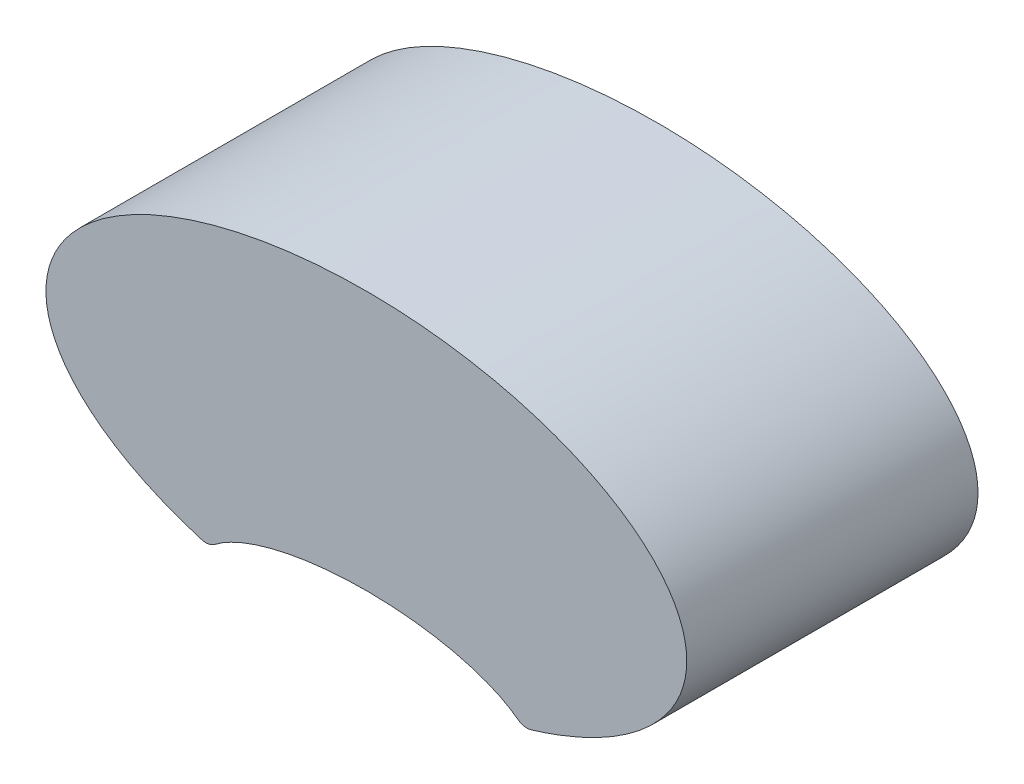
ISO-10303-21;
HEADER;
FILE_DESCRIPTION(('STEP AP214'),'2;1');
FILE_NAME('part.step','',(''),(''),'','','');
FILE_SCHEMA(('AUTOMOTIVE_DESIGN { 1 0 10303 214 1 1 1 1 }'));
ENDSEC;
DATA;
#1=APPLICATION_CONTEXT('core data for automotive mechanical design processes');
#2=APPLICATION_PROTOCOL_DEFINITION('international standard','automotive_design',2000,#1);
#3=PRODUCT_CONTEXT('',#1,'mechanical');
#4=PRODUCT('Part','Part','',(#3));
#5=PRODUCT_RELATED_PRODUCT_CATEGORY('part','',(#4));
#6=PRODUCT_DEFINITION_FORMATION('','',#4);
#7=PRODUCT_DEFINITION_CONTEXT('part definition',#1,'design');
#8=PRODUCT_DEFINITION('design','',#6,#7);
#9=PRODUCT_DEFINITION_SHAPE('','',#8);
#10=(LENGTH_UNIT() NAMED_UNIT(*) SI_UNIT(.MILLI.,.METRE.));
#11=(NAMED_UNIT(*) PLANE_ANGLE_UNIT() SI_UNIT($,.RADIAN.));
#12=(NAMED_UNIT(*) SI_UNIT($,.STERADIAN.) SOLID_ANGLE_UNIT());
#13=UNCERTAINTY_MEASURE_WITH_UNIT(LENGTH_MEASURE(1.E-05),#10,'distance_accuracy_value','');
#14=(GEOMETRIC_REPRESENTATION_CONTEXT(3) GLOBAL_UNCERTAINTY_ASSIGNED_CONTEXT((#13)) GLOBAL_UNIT_ASSIGNED_CONTEXT((#10,
#11,#12)) REPRESENTATION_CONTEXT('',''));
#15=CARTESIAN_POINT('',(0.,0.,0.));
#16=DIRECTION('',(0.,0.,1.));
#17=DIRECTION('',(1.,0.,0.));
#18=AXIS2_PLACEMENT_3D('',#15,#16,#17);
#19=CARTESIAN_POINT('',(0.,0.,-1.));
#20=DIRECTION('',(0.,0.,1.));
#21=DIRECTION('',(1.,0.,0.));
#22=AXIS2_PLACEMENT_3D('',#19,#20,#21);
#23=PLANE('',#22);
#24=CARTESIAN_POINT('',(0.,0.220517822577264,-1.));
#25=DIRECTION('',(0.,0.,1.));
#26=DIRECTION('',(1.,0.,0.));
#27=AXIS2_PLACEMENT_3D('',#24,#25,#26);
#28=ELLIPSE('',#27,0.580458558653862,0.220517822577264);
#29=CARTESIAN_POINT('',(-0.520495625253044,0.318128771506584,-1.));
#30=VERTEX_POINT('',#29);
#31=CARTESIAN_POINT('',(0.520495625253044,0.318128771506584,-1.));
#32=VERTEX_POINT('',#31);
#33=EDGE_CURVE('E79',#30,#32,#28,.F.);
#34=ORIENTED_EDGE('',*,*,#33,.F.);
#35=CARTESIAN_POINT('',(-0.55099028542075,0.357752952271063,-1.));
#36=DIRECTION('',(0.,0.,1.));
#37=DIRECTION('',(1.,0.,0.));
#38=AXIS2_PLACEMENT_3D('',#35,#36,#37);
#39=CIRCLE('',#38,0.05);
#40=CARTESIAN_POINT('',(-0.565338464899144,0.309855877771092,-1.));
#41=VERTEX_POINT('',#40);
#42=EDGE_CURVE('E150',#41,#30,#39,.T.);
#43=ORIENTED_EDGE('',*,*,#42,.F.);
#44=CARTESIAN_POINT('',(0.,0.781658914033439,-1.));
#45=DIRECTION('',(0.,0.,-1.));
#46=DIRECTION('',(1.,0.,0.));
#47=AXIS2_PLACEMENT_3D('',#44,#45,#46);
#48=ELLIPSE('',#47,1.1,0.55);
#49=CARTESIAN_POINT('',(0.565338464899143,0.309855877771092,-1.));
#50=VERTEX_POINT('',#49);
#51=EDGE_CURVE('E73',#50,#41,#48,.F.);
#52=ORIENTED_EDGE('',*,*,#51,.F.);
#53=CARTESIAN_POINT('',(0.55099028542075,0.357752952271063,-1.));
#54=DIRECTION('',(0.,0.,1.));
#55=DIRECTION('',(1.,0.,0.));
#56=AXIS2_PLACEMENT_3D('',#53,#54,#55);
#57=CIRCLE('',#56,0.05);
#58=EDGE_CURVE('E12',#32,#50,#57,.T.);
#59=ORIENTED_EDGE('',*,*,#58,.F.);
#60=EDGE_LOOP('',(#34,#43,#52,#59));
#61=FACE_BOUND('',#60,.T.);
#62=ADVANCED_FACE('F69',(#61),#23,.F.);
#63=CARTESIAN_POINT('',(0.55099028542075,0.357752952271063,-3.42659914665207));
#64=DIRECTION('',(0.,0.,1.));
#65=DIRECTION('',(1.,0.,0.));
#66=AXIS2_PLACEMENT_3D('',#63,#64,#65);
#67=CYLINDRICAL_SURFACE('',#66,0.05);
#68=DIRECTION('',(0.,0.,1.));
#69=VECTOR('',#68,1.);
#70=CARTESIAN_POINT('',(0.520495625253044,0.318128771506584,-3.42659914665207));
#71=LINE('',#70,#69);
#72=CARTESIAN_POINT('',(0.520495625253044,0.318128771506584,0.));
#73=VERTEX_POINT('',#72);
#74=EDGE_CURVE('E141',#32,#73,#71,.T.);
#75=ORIENTED_EDGE('',*,*,#74,.F.);
#76=ORIENTED_EDGE('',*,*,#58,.T.);
#77=DIRECTION('',(0.,0.,1.));
#78=VECTOR('',#77,1.);
#79=CARTESIAN_POINT('',(0.565338464899143,0.309855877771092,-3.42659914665207));
#80=LINE('',#79,#78);
#81=CARTESIAN_POINT('',(0.565338464899143,0.309855877771092,0.));
#82=VERTEX_POINT('',#81);
#83=EDGE_CURVE('E109',#50,#82,#80,.T.);
#84=ORIENTED_EDGE('',*,*,#83,.T.);
#85=CARTESIAN_POINT('',(0.55099028542075,0.357752952271063,0.));
#86=DIRECTION('',(0.,0.,1.));
#87=DIRECTION('',(1.,0.,0.));
#88=AXIS2_PLACEMENT_3D('',#85,#86,#87);
#89=CIRCLE('',#88,0.05);
#90=EDGE_CURVE('E113',#82,#73,#89,.F.);
#91=ORIENTED_EDGE('',*,*,#90,.T.);
#92=EDGE_LOOP('',(#75,#76,#84,#91));
#93=FACE_BOUND('',#92,.T.);
#94=ADVANCED_FACE('F71',(#93),#67,.T.);
#95=CARTESIAN_POINT('',(-0.55099028542075,0.357752952271063,-3.42659914665207));
#96=DIRECTION('',(0.,0.,1.));
#97=DIRECTION('',(1.,0.,0.));
#98=AXIS2_PLACEMENT_3D('',#95,#96,#97);
#99=CYLINDRICAL_SURFACE('',#98,0.05);
#100=DIRECTION('',(0.,0.,1.));
#101=VECTOR('',#100,1.);
#102=CARTESIAN_POINT('',(-0.565338464899144,0.309855877771092,-3.42659914665207));
#103=LINE('',#102,#101);
#104=CARTESIAN_POINT('',(-0.565338464899144,0.309855877771092,0.));
#105=VERTEX_POINT('',#104);
#106=EDGE_CURVE('E116',#41,#105,#103,.T.);
#107=ORIENTED_EDGE('',*,*,#106,.F.);
#108=ORIENTED_EDGE('',*,*,#42,.T.);
#109=DIRECTION('',(0.,0.,1.));
#110=VECTOR('',#109,1.);
#111=CARTESIAN_POINT('',(-0.520495625253044,0.318128771506584,-3.42659914665207));
#112=LINE('',#111,#110);
#113=CARTESIAN_POINT('',(-0.520495625253044,0.318128771506584,0.));
#114=VERTEX_POINT('',#113);
#115=EDGE_CURVE('E144',#30,#114,#112,.T.);
#116=ORIENTED_EDGE('',*,*,#115,.T.);
#117=CARTESIAN_POINT('',(-0.55099028542075,0.357752952271063,0.));
#118=DIRECTION('',(0.,0.,1.));
#119=DIRECTION('',(1.,0.,0.));
#120=AXIS2_PLACEMENT_3D('',#117,#118,#119);
#121=CIRCLE('',#120,0.05);
#122=EDGE_CURVE('E126',#114,#105,#121,.F.);
#123=ORIENTED_EDGE('',*,*,#122,.T.);
#124=EDGE_LOOP('',(#107,#108,#116,#123));
#125=FACE_BOUND('',#124,.T.);
#126=ADVANCED_FACE('F160',(#125),#99,.T.);
#127=CARTESIAN_POINT('',(0.,0.,0.));
#128=DIRECTION('',(0.,0.,1.));
#129=DIRECTION('',(1.,0.,0.));
#130=AXIS2_PLACEMENT_3D('',#127,#128,#129);
#131=PLANE('',#130);
#132=ORIENTED_EDGE('',*,*,#90,.F.);
#133=CARTESIAN_POINT('',(0.,0.781658914033439,0.));
#134=DIRECTION('',(0.,0.,-1.));
#135=DIRECTION('',(1.,0.,0.));
#136=AXIS2_PLACEMENT_3D('',#133,#134,#135);
#137=ELLIPSE('',#136,1.1,0.55);
#138=EDGE_CURVE('E119',#105,#82,#137,.T.);
#139=ORIENTED_EDGE('',*,*,#138,.F.);
#140=ORIENTED_EDGE('',*,*,#122,.F.);
#141=CARTESIAN_POINT('',(0.,0.220517822577264,0.));
#142=DIRECTION('',(0.,0.,1.));
#143=DIRECTION('',(1.,0.,0.));
#144=AXIS2_PLACEMENT_3D('',#141,#142,#143);
#145=ELLIPSE('',#144,0.580458558653862,0.220517822577264);
#146=EDGE_CURVE('E117',#73,#114,#145,.T.);
#147=ORIENTED_EDGE('',*,*,#146,.F.);
#148=EDGE_LOOP('',(#132,#139,#140,#147));
#149=FACE_BOUND('',#148,.T.);
#150=ADVANCED_FACE('F129',(#149),#131,.T.);
#151=CARTESIAN_POINT('',(0.,0.220517822577264,-3.42659914665207));
#152=DIRECTION('',(0.,0.,1.));
#153=DIRECTION('',(1.,0.,0.));
#154=AXIS2_PLACEMENT_3D('',#151,#152,#153);
#155=ELLIPSE('',#154,0.580458558653862,0.220517822577264);
#156=DIRECTION('',(0.,0.,1.));
#157=VECTOR('',#156,1.);
#158=SURFACE_OF_LINEAR_EXTRUSION('',#155,#157);
#159=ORIENTED_EDGE('',*,*,#115,.F.);
#160=ORIENTED_EDGE('',*,*,#33,.T.);
#161=ORIENTED_EDGE('',*,*,#74,.T.);
#162=ORIENTED_EDGE('',*,*,#146,.T.);
#163=EDGE_LOOP('',(#159,#160,#161,#162));
#164=FACE_BOUND('',#163,.T.);
#165=ADVANCED_FACE('F159',(#164),#158,.F.);
#166=CARTESIAN_POINT('',(0.,0.781658914033439,-3.42659914665207));
#167=DIRECTION('',(0.,0.,-1.));
#168=DIRECTION('',(1.,0.,0.));
#169=AXIS2_PLACEMENT_3D('',#166,#167,#168);
#170=ELLIPSE('',#169,1.1,0.55);
#171=DIRECTION('',(0.,0.,1.));
#172=VECTOR('',#171,1.);
#173=SURFACE_OF_LINEAR_EXTRUSION('',#170,#172);
#174=ORIENTED_EDGE('',*,*,#83,.F.);
#175=ORIENTED_EDGE('',*,*,#51,.T.);
#176=ORIENTED_EDGE('',*,*,#106,.T.);
#177=ORIENTED_EDGE('',*,*,#138,.T.);
#178=EDGE_LOOP('',(#174,#175,#176,#177));
#179=FACE_BOUND('',#178,.T.);
#180=ADVANCED_FACE('F120',(#179),#173,.F.);
#181=CLOSED_SHELL('',(#62,#94,#126,#150,#165,#180));
#182=MANIFOLD_SOLID_BREP('B2',#181);
#183=ADVANCED_BREP_SHAPE_REPRESENTATION('',(#18,#182),#14);
#184=SHAPE_DEFINITION_REPRESENTATION(#9,#183);
ENDSEC;
END-ISO-10303-21;
